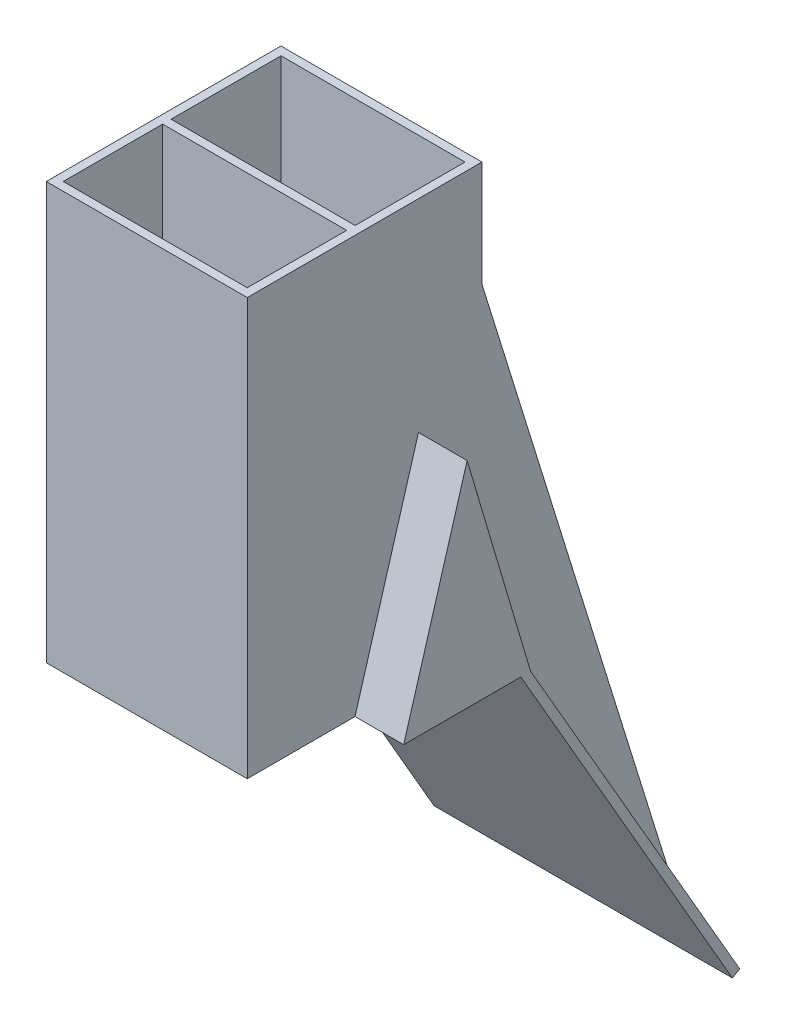
ISO-10303-21;
HEADER;
FILE_DESCRIPTION(('STEP AP214'),'2;1');
FILE_NAME('part.step','',(''),(''),'','','');
FILE_SCHEMA(('AUTOMOTIVE_DESIGN { 1 0 10303 214 1 1 1 1 }'));
ENDSEC;
DATA;
#1=APPLICATION_CONTEXT('core data for automotive mechanical design processes');
#2=APPLICATION_PROTOCOL_DEFINITION('international standard','automotive_design',2000,#1);
#3=PRODUCT_CONTEXT('',#1,'mechanical');
#4=PRODUCT('Part','Part','',(#3));
#5=PRODUCT_RELATED_PRODUCT_CATEGORY('part','',(#4));
#6=PRODUCT_DEFINITION_FORMATION('','',#4);
#7=PRODUCT_DEFINITION_CONTEXT('part definition',#1,'design');
#8=PRODUCT_DEFINITION('design','',#6,#7);
#9=PRODUCT_DEFINITION_SHAPE('','',#8);
#10=(LENGTH_UNIT() NAMED_UNIT(*) SI_UNIT(.MILLI.,.METRE.));
#11=(NAMED_UNIT(*) PLANE_ANGLE_UNIT() SI_UNIT($,.RADIAN.));
#12=(NAMED_UNIT(*) SI_UNIT($,.STERADIAN.) SOLID_ANGLE_UNIT());
#13=UNCERTAINTY_MEASURE_WITH_UNIT(LENGTH_MEASURE(1.E-05),#10,'distance_accuracy_value','');
#14=(GEOMETRIC_REPRESENTATION_CONTEXT(3) GLOBAL_UNCERTAINTY_ASSIGNED_CONTEXT((#13)) GLOBAL_UNIT_ASSIGNED_CONTEXT((#10,
#11,#12)) REPRESENTATION_CONTEXT('',''));
#15=CARTESIAN_POINT('',(0.,0.,0.));
#16=DIRECTION('',(0.,0.,1.));
#17=DIRECTION('',(1.,0.,0.));
#18=AXIS2_PLACEMENT_3D('',#15,#16,#17);
#19=CARTESIAN_POINT('',(11.8,-17.1205080756888,-20.9775299461621));
#20=DIRECTION('',(0.,0.5,-0.866025403784439));
#21=DIRECTION('',(0.,0.866025403784439,0.5));
#22=AXIS2_PLACEMENT_3D('',#19,#20,#21);
#23=PLANE('',#22);
#24=DIRECTION('',(1.,0.,0.));
#25=VECTOR('',#24,1.);
#26=CARTESIAN_POINT('',(-2.3,0.,-11.093));
#27=LINE('',#26,#25);
#28=CARTESIAN_POINT('',(-2.3,0.,-11.093));
#29=VERTEX_POINT('',#28);
#30=CARTESIAN_POINT('',(0.,0.,-11.093));
#31=VERTEX_POINT('',#30);
#32=EDGE_CURVE('E271',#29,#31,#27,.T.);
#33=ORIENTED_EDGE('',*,*,#32,.T.);
#34=DIRECTION('',(0.,0.866025403784438,0.5));
#35=VECTOR('',#34,1.);
#36=CARTESIAN_POINT('',(0.,-17.1205080756888,-20.9775299461621));
#37=LINE('',#36,#35);
#38=CARTESIAN_POINT('',(0.,-17.1205080756888,-20.9775299461621));
#39=VERTEX_POINT('',#38);
#40=EDGE_CURVE('E269',#39,#31,#37,.T.);
#41=ORIENTED_EDGE('',*,*,#40,.F.);
#42=DIRECTION('',(-1.,0.,0.));
#43=VECTOR('',#42,1.);
#44=CARTESIAN_POINT('',(11.8,-17.1205080756888,-20.9775299461621));
#45=LINE('',#44,#43);
#46=CARTESIAN_POINT('',(-2.3,-17.1205080756888,-20.9775299461621));
#47=VERTEX_POINT('',#46);
#48=EDGE_CURVE('E254',#39,#47,#45,.T.);
#49=ORIENTED_EDGE('',*,*,#48,.T.);
#50=DIRECTION('',(0.,-0.866025403784438,-0.5));
#51=VECTOR('',#50,1.);
#52=CARTESIAN_POINT('',(-2.3,-17.1205080756888,-20.9775299461621));
#53=LINE('',#52,#51);
#54=EDGE_CURVE('E295',#29,#47,#53,.T.);
#55=ORIENTED_EDGE('',*,*,#54,.F.);
#56=EDGE_LOOP('',(#33,#41,#49,#55));
#57=FACE_BOUND('',#56,.T.);
#58=ADVANCED_FACE('F39',(#57),#23,.T.);
#59=CARTESIAN_POINT('',(0.399999999999999,19.7,-5.5));
#60=DIRECTION('',(1.,0.,0.));
#61=DIRECTION('',(0.,0.,-1.));
#62=AXIS2_PLACEMENT_3D('',#59,#60,#61);
#63=PLANE('',#62);
#64=DIRECTION('',(0.,-0.958836299508465,0.283959417426001));
#65=VECTOR('',#64,1.);
#66=CARTESIAN_POINT('',(0.4,18.10876123634,-10.8730828919585));
#67=LINE('',#66,#65);
#68=CARTESIAN_POINT('',(0.399999999999999,8.7213480044935,-8.093));
#69=VERTEX_POINT('',#68);
#70=CARTESIAN_POINT('',(0.399999999999999,1.,-5.80632240735632));
#71=VERTEX_POINT('',#70);
#72=EDGE_CURVE('E429',#69,#71,#67,.T.);
#73=ORIENTED_EDGE('',*,*,#72,.F.);
#74=DIRECTION('',(0.,0.958836299508465,0.283959417426001));
#75=VECTOR('',#74,1.);
#76=CARTESIAN_POINT('',(0.399999999999999,19.5207565524615,-4.89475462547838));
#77=LINE('',#76,#75);
#78=CARTESIAN_POINT('',(0.4,0.999999999999997,-10.3796775926437));
#79=VERTEX_POINT('',#78);
#80=EDGE_CURVE('E415',#79,#69,#77,.T.);
#81=ORIENTED_EDGE('',*,*,#80,.F.);
#82=DIRECTION('',(0.,0.,-1.));
#83=VECTOR('',#82,1.);
#84=CARTESIAN_POINT('',(0.399999999999999,1.,-5.5));
#85=LINE('',#84,#83);
#86=EDGE_CURVE('E421',#71,#79,#85,.T.);
#87=ORIENTED_EDGE('',*,*,#86,.F.);
#88=EDGE_LOOP('',(#73,#81,#87));
#89=FACE_BOUND('',#88,.T.);
#90=DIRECTION('',(0.,-1.,0.));
#91=VECTOR('',#90,1.);
#92=CARTESIAN_POINT('',(0.399999999999999,19.7,-5.5));
#93=LINE('',#92,#91);
#94=CARTESIAN_POINT('',(0.399999999999999,19.7,-5.5));
#95=VERTEX_POINT('',#94);
#96=CARTESIAN_POINT('',(0.399999999999999,0.4,-5.5));
#97=VERTEX_POINT('',#96);
#98=EDGE_CURVE('E520',#95,#97,#93,.T.);
#99=ORIENTED_EDGE('',*,*,#98,.T.);
#100=DIRECTION('',(0.,0.,-1.));
#101=VECTOR('',#100,1.);
#102=CARTESIAN_POINT('',(0.399999999999999,0.400000000000001,-5.5));
#103=LINE('',#102,#101);
#104=CARTESIAN_POINT('',(0.4,0.400000000000001,-10.693));
#105=VERTEX_POINT('',#104);
#106=EDGE_CURVE('E371',#97,#105,#103,.T.);
#107=ORIENTED_EDGE('',*,*,#106,.T.);
#108=DIRECTION('',(0.,-1.,0.));
#109=VECTOR('',#108,1.);
#110=CARTESIAN_POINT('',(0.4,19.7,-10.693));
#111=LINE('',#110,#109);
#112=CARTESIAN_POINT('',(0.4,19.7,-10.693));
#113=VERTEX_POINT('',#112);
#114=EDGE_CURVE('E503',#113,#105,#111,.T.);
#115=ORIENTED_EDGE('',*,*,#114,.F.);
#116=DIRECTION('',(0.,0.,1.));
#117=VECTOR('',#116,1.);
#118=CARTESIAN_POINT('',(0.399999999999999,19.7,-5.5));
#119=LINE('',#118,#117);
#120=EDGE_CURVE('E489',#113,#95,#119,.T.);
#121=ORIENTED_EDGE('',*,*,#120,.T.);
#122=EDGE_LOOP('',(#99,#107,#115,#121));
#123=FACE_BOUND('',#122,.T.);
#124=ADVANCED_FACE('F660',(#89,#123),#63,.T.);
#125=CARTESIAN_POINT('',(9.1,19.7,-5.5));
#126=DIRECTION('',(-1.,0.,0.));
#127=DIRECTION('',(0.,0.,1.));
#128=AXIS2_PLACEMENT_3D('',#125,#126,#127);
#129=PLANE('',#128);
#130=DIRECTION('',(0.,0.958836299508465,-0.283959417426001));
#131=VECTOR('',#130,1.);
#132=CARTESIAN_POINT('',(9.1,18.10876123634,-10.8730828919585));
#133=LINE('',#132,#131);
#134=CARTESIAN_POINT('',(9.1,1.,-5.80632240735632));
#135=VERTEX_POINT('',#134);
#136=CARTESIAN_POINT('',(9.1,8.7213480044935,-8.093));
#137=VERTEX_POINT('',#136);
#138=EDGE_CURVE('E425',#135,#137,#133,.T.);
#139=ORIENTED_EDGE('',*,*,#138,.F.);
#140=DIRECTION('',(0.,0.,1.));
#141=VECTOR('',#140,1.);
#142=CARTESIAN_POINT('',(9.1,1.,-5.5));
#143=LINE('',#142,#141);
#144=CARTESIAN_POINT('',(9.1,1.,-10.3796775926437));
#145=VERTEX_POINT('',#144);
#146=EDGE_CURVE('E418',#145,#135,#143,.T.);
#147=ORIENTED_EDGE('',*,*,#146,.F.);
#148=DIRECTION('',(0.,-0.958836299508465,-0.283959417426001));
#149=VECTOR('',#148,1.);
#150=CARTESIAN_POINT('',(9.1,19.5207565524615,-4.89475462547838));
#151=LINE('',#150,#149);
#152=EDGE_CURVE('E403',#137,#145,#151,.T.);
#153=ORIENTED_EDGE('',*,*,#152,.F.);
#154=EDGE_LOOP('',(#139,#147,#153));
#155=FACE_BOUND('',#154,.T.);
#156=DIRECTION('',(0.,-1.,0.));
#157=VECTOR('',#156,1.);
#158=CARTESIAN_POINT('',(9.1,19.7,-10.693));
#159=LINE('',#158,#157);
#160=CARTESIAN_POINT('',(9.1,19.7,-10.693));
#161=VERTEX_POINT('',#160);
#162=CARTESIAN_POINT('',(9.1,0.4,-10.693));
#163=VERTEX_POINT('',#162);
#164=EDGE_CURVE('E512',#161,#163,#159,.T.);
#165=ORIENTED_EDGE('',*,*,#164,.T.);
#166=DIRECTION('',(0.,0.,1.));
#167=VECTOR('',#166,1.);
#168=CARTESIAN_POINT('',(9.1,0.400000000000001,-5.5));
#169=LINE('',#168,#167);
#170=CARTESIAN_POINT('',(9.1,0.400000000000001,-5.5));
#171=VERTEX_POINT('',#170);
#172=EDGE_CURVE('E356',#163,#171,#169,.T.);
#173=ORIENTED_EDGE('',*,*,#172,.T.);
#174=DIRECTION('',(0.,-1.,0.));
#175=VECTOR('',#174,1.);
#176=CARTESIAN_POINT('',(9.1,19.7,-5.5));
#177=LINE('',#176,#175);
#178=CARTESIAN_POINT('',(9.1,19.7,-5.5));
#179=VERTEX_POINT('',#178);
#180=EDGE_CURVE('E516',#179,#171,#177,.T.);
#181=ORIENTED_EDGE('',*,*,#180,.F.);
#182=DIRECTION('',(0.,0.,-1.));
#183=VECTOR('',#182,1.);
#184=CARTESIAN_POINT('',(9.1,19.7,-5.5));
#185=LINE('',#184,#183);
#186=EDGE_CURVE('E496',#179,#161,#185,.T.);
#187=ORIENTED_EDGE('',*,*,#186,.T.);
#188=EDGE_LOOP('',(#165,#173,#181,#187));
#189=FACE_BOUND('',#188,.T.);
#190=ADVANCED_FACE('F665',(#155,#189),#129,.T.);
#191=CARTESIAN_POINT('',(0.,19.7,0.));
#192=DIRECTION('',(1.,0.,0.));
#193=DIRECTION('',(0.,0.,-1.));
#194=AXIS2_PLACEMENT_3D('',#191,#192,#193);
#195=PLANE('',#194);
#196=DIRECTION('',(0.,-0.958836299508464,-0.283959417426001));
#197=VECTOR('',#196,1.);
#198=CARTESIAN_POINT('',(0.,0.,-11.093));
#199=LINE('',#198,#197);
#200=CARTESIAN_POINT('',(0.,10.13,-8.093));
#201=VERTEX_POINT('',#200);
#202=EDGE_CURVE('E466',#201,#31,#199,.T.);
#203=ORIENTED_EDGE('',*,*,#202,.F.);
#204=DIRECTION('',(0.,0.958836299508464,-0.283959417426001));
#205=VECTOR('',#204,1.);
#206=CARTESIAN_POINT('',(0.,10.13,-8.093));
#207=LINE('',#206,#205);
#208=CARTESIAN_POINT('',(0.,0.,-5.093));
#209=VERTEX_POINT('',#208);
#210=EDGE_CURVE('E461',#209,#201,#207,.T.);
#211=ORIENTED_EDGE('',*,*,#210,.F.);
#212=DIRECTION('',(0.,0.,1.));
#213=VECTOR('',#212,1.);
#214=CARTESIAN_POINT('',(0.,0.,0.));
#215=LINE('',#214,#213);
#216=CARTESIAN_POINT('',(0.,0.,0.));
#217=VERTEX_POINT('',#216);
#218=EDGE_CURVE('E567',#209,#217,#215,.T.);
#219=ORIENTED_EDGE('',*,*,#218,.T.);
#220=DIRECTION('',(0.,-1.,0.));
#221=VECTOR('',#220,1.);
#222=CARTESIAN_POINT('',(0.,19.7,0.));
#223=LINE('',#222,#221);
#224=CARTESIAN_POINT('',(0.,19.7,0.));
#225=VERTEX_POINT('',#224);
#226=EDGE_CURVE('E11',#225,#217,#223,.T.);
#227=ORIENTED_EDGE('',*,*,#226,.F.);
#228=DIRECTION('',(0.,0.,1.));
#229=VECTOR('',#228,1.);
#230=CARTESIAN_POINT('',(0.,19.7,0.));
#231=LINE('',#230,#229);
#232=CARTESIAN_POINT('',(0.,19.7,-11.093));
#233=VERTEX_POINT('',#232);
#234=EDGE_CURVE('E568',#233,#225,#231,.T.);
#235=ORIENTED_EDGE('',*,*,#234,.F.);
#236=DIRECTION('',(0.,-1.,0.));
#237=VECTOR('',#236,1.);
#238=CARTESIAN_POINT('',(0.,19.7,-11.093));
#239=LINE('',#238,#237);
#240=CARTESIAN_POINT('',(0.,14.7,-11.093));
#241=VERTEX_POINT('',#240);
#242=EDGE_CURVE('E288',#233,#241,#239,.T.);
#243=ORIENTED_EDGE('',*,*,#242,.T.);
#244=DIRECTION('',(0.,-0.954985944356835,-0.296651051036202));
#245=VECTOR('',#244,1.);
#246=CARTESIAN_POINT('',(0.,14.7,-11.093));
#247=LINE('',#246,#245);
#248=EDGE_CURVE('E277',#241,#39,#247,.T.);
#249=ORIENTED_EDGE('',*,*,#248,.T.);
#250=ORIENTED_EDGE('',*,*,#40,.T.);
#251=EDGE_LOOP('',(#203,#211,#219,#227,#235,#243,#249,#250));
#252=FACE_BOUND('',#251,.T.);
#253=ADVANCED_FACE('F41',(#252),#195,.F.);
#254=CARTESIAN_POINT('',(0.,19.7,0.));
#255=DIRECTION('',(0.,-1.,0.));
#256=DIRECTION('',(0.,0.,-1.));
#257=AXIS2_PLACEMENT_3D('',#254,#255,#256);
#258=PLANE('',#257);
#259=DIRECTION('',(1.,0.,0.));
#260=VECTOR('',#259,1.);
#261=CARTESIAN_POINT('',(0.4,19.7,-0.4));
#262=LINE('',#261,#260);
#263=CARTESIAN_POINT('',(0.4,19.7,-0.4));
#264=VERTEX_POINT('',#263);
#265=CARTESIAN_POINT('',(9.1,19.7,-0.4));
#266=VERTEX_POINT('',#265);
#267=EDGE_CURVE('E525',#264,#266,#262,.T.);
#268=ORIENTED_EDGE('',*,*,#267,.F.);
#269=DIRECTION('',(0.,0.,1.));
#270=VECTOR('',#269,1.);
#271=CARTESIAN_POINT('',(0.4,19.7,-0.4));
#272=LINE('',#271,#270);
#273=CARTESIAN_POINT('',(0.4,19.7,-5.1));
#274=VERTEX_POINT('',#273);
#275=EDGE_CURVE('E536',#274,#264,#272,.T.);
#276=ORIENTED_EDGE('',*,*,#275,.F.);
#277=DIRECTION('',(-1.,0.,0.));
#278=VECTOR('',#277,1.);
#279=CARTESIAN_POINT('',(0.4,19.7,-5.1));
#280=LINE('',#279,#278);
#281=CARTESIAN_POINT('',(9.1,19.7,-5.1));
#282=VERTEX_POINT('',#281);
#283=EDGE_CURVE('E532',#282,#274,#280,.T.);
#284=ORIENTED_EDGE('',*,*,#283,.F.);
#285=DIRECTION('',(0.,0.,-1.));
#286=VECTOR('',#285,1.);
#287=CARTESIAN_POINT('',(9.1,19.7,-0.4));
#288=LINE('',#287,#286);
#289=EDGE_CURVE('E528',#266,#282,#288,.T.);
#290=ORIENTED_EDGE('',*,*,#289,.F.);
#291=EDGE_LOOP('',(#268,#276,#284,#290));
#292=FACE_BOUND('',#291,.T.);
#293=ORIENTED_EDGE('',*,*,#234,.T.);
#294=DIRECTION('',(1.,0.,0.));
#295=VECTOR('',#294,1.);
#296=CARTESIAN_POINT('',(0.,19.7,0.));
#297=LINE('',#296,#295);
#298=CARTESIAN_POINT('',(9.5,19.7,0.));
#299=VERTEX_POINT('',#298);
#300=EDGE_CURVE('E572',#225,#299,#297,.T.);
#301=ORIENTED_EDGE('',*,*,#300,.T.);
#302=DIRECTION('',(0.,0.,-1.));
#303=VECTOR('',#302,1.);
#304=CARTESIAN_POINT('',(9.5,19.7,0.));
#305=LINE('',#304,#303);
#306=CARTESIAN_POINT('',(9.5,19.7,-11.093));
#307=VERTEX_POINT('',#306);
#308=EDGE_CURVE('E576',#299,#307,#305,.T.);
#309=ORIENTED_EDGE('',*,*,#308,.T.);
#310=DIRECTION('',(-1.,0.,0.));
#311=VECTOR('',#310,1.);
#312=CARTESIAN_POINT('',(0.,19.7,-11.093));
#313=LINE('',#312,#311);
#314=EDGE_CURVE('E579',#307,#233,#313,.T.);
#315=ORIENTED_EDGE('',*,*,#314,.T.);
#316=EDGE_LOOP('',(#293,#301,#309,#315));
#317=FACE_BOUND('',#316,.T.);
#318=ORIENTED_EDGE('',*,*,#120,.F.);
#319=DIRECTION('',(-1.,0.,0.));
#320=VECTOR('',#319,1.);
#321=CARTESIAN_POINT('',(0.4,19.7,-10.693));
#322=LINE('',#321,#320);
#323=EDGE_CURVE('E500',#161,#113,#322,.T.);
#324=ORIENTED_EDGE('',*,*,#323,.F.);
#325=ORIENTED_EDGE('',*,*,#186,.F.);
#326=DIRECTION('',(1.,0.,0.));
#327=VECTOR('',#326,1.);
#328=CARTESIAN_POINT('',(9.1,19.7,-5.5));
#329=LINE('',#328,#327);
#330=EDGE_CURVE('E492',#95,#179,#329,.T.);
#331=ORIENTED_EDGE('',*,*,#330,.F.);
#332=EDGE_LOOP('',(#318,#324,#325,#331));
#333=FACE_BOUND('',#332,.T.);
#334=ADVANCED_FACE('F644',(#292,#317,#333),#258,.F.);
#335=CARTESIAN_POINT('',(0.,0.,0.));
#336=DIRECTION('',(0.,-1.,0.));
#337=DIRECTION('',(0.,0.,-1.));
#338=AXIS2_PLACEMENT_3D('',#335,#336,#337);
#339=PLANE('',#338);
#340=DIRECTION('',(-1.,0.,0.));
#341=VECTOR('',#340,1.);
#342=CARTESIAN_POINT('',(11.8,0.,-10.6311197846483));
#343=LINE('',#342,#341);
#344=CARTESIAN_POINT('',(11.8,0.,-10.6311197846483));
#345=VERTEX_POINT('',#344);
#346=CARTESIAN_POINT('',(11.4,0.,-10.6311197846483));
#347=VERTEX_POINT('',#346);
#348=EDGE_CURVE('E315',#345,#347,#343,.T.);
#349=ORIENTED_EDGE('',*,*,#348,.F.);
#350=DIRECTION('',(0.,0.,1.));
#351=VECTOR('',#350,1.);
#352=CARTESIAN_POINT('',(11.8,0.,-5.093));
#353=LINE('',#352,#351);
#354=CARTESIAN_POINT('',(11.8,0.,-5.093));
#355=VERTEX_POINT('',#354);
#356=EDGE_CURVE('E433',#345,#355,#353,.T.);
#357=ORIENTED_EDGE('',*,*,#356,.T.);
#358=DIRECTION('',(-1.,0.,0.));
#359=VECTOR('',#358,1.);
#360=CARTESIAN_POINT('',(11.8,0.,-5.093));
#361=LINE('',#360,#359);
#362=CARTESIAN_POINT('',(9.5,0.,-5.093));
#363=VERTEX_POINT('',#362);
#364=EDGE_CURVE('E445',#355,#363,#361,.T.);
#365=ORIENTED_EDGE('',*,*,#364,.T.);
#366=DIRECTION('',(0.,0.,-1.));
#367=VECTOR('',#366,1.);
#368=CARTESIAN_POINT('',(9.5,0.,0.));
#369=LINE('',#368,#367);
#370=CARTESIAN_POINT('',(9.5,0.,0.));
#371=VERTEX_POINT('',#370);
#372=EDGE_CURVE('E573',#371,#363,#369,.T.);
#373=ORIENTED_EDGE('',*,*,#372,.F.);
#374=DIRECTION('',(1.,0.,0.));
#375=VECTOR('',#374,1.);
#376=CARTESIAN_POINT('',(0.,0.,0.));
#377=LINE('',#376,#375);
#378=EDGE_CURVE('E584',#217,#371,#377,.T.);
#379=ORIENTED_EDGE('',*,*,#378,.F.);
#380=ORIENTED_EDGE('',*,*,#218,.F.);
#381=DIRECTION('',(1.,0.,0.));
#382=VECTOR('',#381,1.);
#383=CARTESIAN_POINT('',(-2.3,0.,-5.093));
#384=LINE('',#383,#382);
#385=CARTESIAN_POINT('',(-2.3,0.,-5.093));
#386=VERTEX_POINT('',#385);
#387=EDGE_CURVE('E484',#386,#209,#384,.T.);
#388=ORIENTED_EDGE('',*,*,#387,.F.);
#389=DIRECTION('',(0.,0.,1.));
#390=VECTOR('',#389,1.);
#391=CARTESIAN_POINT('',(-2.3,0.,-5.093));
#392=LINE('',#391,#390);
#393=CARTESIAN_POINT('',(-2.3,0.,-10.6311197846483));
#394=VERTEX_POINT('',#393);
#395=EDGE_CURVE('E462',#394,#386,#392,.T.);
#396=ORIENTED_EDGE('',*,*,#395,.F.);
#397=CARTESIAN_POINT('',(-1.9,0.,-10.6311197846483));
#398=VERTEX_POINT('',#397);
#399=EDGE_CURVE('E321',#398,#394,#343,.T.);
#400=ORIENTED_EDGE('',*,*,#399,.F.);
#401=DIRECTION('',(0.,0.,-1.));
#402=VECTOR('',#401,1.);
#403=CARTESIAN_POINT('',(-1.9,0.,-5.5));
#404=LINE('',#403,#402);
#405=CARTESIAN_POINT('',(-1.9,0.,-5.5));
#406=VERTEX_POINT('',#405);
#407=EDGE_CURVE('E344',#406,#398,#404,.T.);
#408=ORIENTED_EDGE('',*,*,#407,.F.);
#409=DIRECTION('',(1.,0.,0.));
#410=VECTOR('',#409,1.);
#411=CARTESIAN_POINT('',(9.1,0.,-5.5));
#412=LINE('',#411,#410);
#413=CARTESIAN_POINT('',(11.4,0.,-5.5));
#414=VERTEX_POINT('',#413);
#415=EDGE_CURVE('E488',#406,#414,#412,.T.);
#416=ORIENTED_EDGE('',*,*,#415,.T.);
#417=DIRECTION('',(0.,0.,1.));
#418=VECTOR('',#417,1.);
#419=CARTESIAN_POINT('',(11.4,0.,-5.5));
#420=LINE('',#419,#418);
#421=EDGE_CURVE('E348',#347,#414,#420,.T.);
#422=ORIENTED_EDGE('',*,*,#421,.F.);
#423=EDGE_LOOP('',(#349,#357,#365,#373,#379,#380,#388,#396,#400,#408,#416,#422));
#424=FACE_BOUND('',#423,.T.);
#425=DIRECTION('',(0.,0.,1.));
#426=VECTOR('',#425,1.);
#427=CARTESIAN_POINT('',(0.4,0.,-0.4));
#428=LINE('',#427,#426);
#429=CARTESIAN_POINT('',(0.4,0.,-5.1));
#430=VERTEX_POINT('',#429);
#431=CARTESIAN_POINT('',(0.4,0.,-0.4));
#432=VERTEX_POINT('',#431);
#433=EDGE_CURVE('E529',#430,#432,#428,.T.);
#434=ORIENTED_EDGE('',*,*,#433,.T.);
#435=DIRECTION('',(1.,0.,0.));
#436=VECTOR('',#435,1.);
#437=CARTESIAN_POINT('',(0.4,0.,-0.4));
#438=LINE('',#437,#436);
#439=CARTESIAN_POINT('',(9.1,0.,-0.4));
#440=VERTEX_POINT('',#439);
#441=EDGE_CURVE('E524',#432,#440,#438,.T.);
#442=ORIENTED_EDGE('',*,*,#441,.T.);
#443=DIRECTION('',(0.,0.,-1.));
#444=VECTOR('',#443,1.);
#445=CARTESIAN_POINT('',(9.1,0.,-0.4));
#446=LINE('',#445,#444);
#447=CARTESIAN_POINT('',(9.1,0.,-5.1));
#448=VERTEX_POINT('',#447);
#449=EDGE_CURVE('E543',#440,#448,#446,.T.);
#450=ORIENTED_EDGE('',*,*,#449,.T.);
#451=DIRECTION('',(-1.,0.,0.));
#452=VECTOR('',#451,1.);
#453=CARTESIAN_POINT('',(0.4,0.,-5.1));
#454=LINE('',#453,#452);
#455=EDGE_CURVE('E547',#448,#430,#454,.T.);
#456=ORIENTED_EDGE('',*,*,#455,.T.);
#457=EDGE_LOOP('',(#434,#442,#450,#456));
#458=FACE_BOUND('',#457,.T.);
#459=ADVANCED_FACE('F604',(#424,#458),#339,.T.);
#460=CARTESIAN_POINT('',(0.,19.7,0.));
#461=DIRECTION('',(0.,0.,-1.));
#462=DIRECTION('',(-1.,0.,0.));
#463=AXIS2_PLACEMENT_3D('',#460,#461,#462);
#464=PLANE('',#463);
#465=ORIENTED_EDGE('',*,*,#378,.T.);
#466=DIRECTION('',(0.,-1.,0.));
#467=VECTOR('',#466,1.);
#468=CARTESIAN_POINT('',(9.5,19.7,0.));
#469=LINE('',#468,#467);
#470=EDGE_CURVE('E48',#299,#371,#469,.T.);
#471=ORIENTED_EDGE('',*,*,#470,.F.);
#472=ORIENTED_EDGE('',*,*,#300,.F.);
#473=ORIENTED_EDGE('',*,*,#226,.T.);
#474=EDGE_LOOP('',(#465,#471,#472,#473));
#475=FACE_BOUND('',#474,.T.);
#476=ADVANCED_FACE('F642',(#475),#464,.F.);
#477=CARTESIAN_POINT('',(9.5,19.7,0.));
#478=DIRECTION('',(-1.,0.,0.));
#479=DIRECTION('',(0.,0.,1.));
#480=AXIS2_PLACEMENT_3D('',#477,#478,#479);
#481=PLANE('',#480);
#482=ORIENTED_EDGE('',*,*,#372,.T.);
#483=DIRECTION('',(0.,0.958836299508464,-0.283959417426001));
#484=VECTOR('',#483,1.);
#485=CARTESIAN_POINT('',(9.5,10.13,-8.093));
#486=LINE('',#485,#484);
#487=CARTESIAN_POINT('',(9.5,10.13,-8.093));
#488=VERTEX_POINT('',#487);
#489=EDGE_CURVE('E437',#363,#488,#486,.T.);
#490=ORIENTED_EDGE('',*,*,#489,.T.);
#491=DIRECTION('',(0.,-0.958836299508464,-0.283959417426001));
#492=VECTOR('',#491,1.);
#493=CARTESIAN_POINT('',(9.5,0.,-11.093));
#494=LINE('',#493,#492);
#495=CARTESIAN_POINT('',(9.5,0.,-11.093));
#496=VERTEX_POINT('',#495);
#497=EDGE_CURVE('E432',#488,#496,#494,.T.);
#498=ORIENTED_EDGE('',*,*,#497,.T.);
#499=DIRECTION('',(0.,0.866025403784438,0.5));
#500=VECTOR('',#499,1.);
#501=CARTESIAN_POINT('',(9.5,-17.1205080756888,-20.9775299461621));
#502=LINE('',#501,#500);
#503=CARTESIAN_POINT('',(9.5,-17.1205080756888,-20.9775299461621));
#504=VERTEX_POINT('',#503);
#505=EDGE_CURVE('E285',#504,#496,#502,.T.);
#506=ORIENTED_EDGE('',*,*,#505,.F.);
#507=DIRECTION('',(0.,-0.954985944356835,-0.296651051036202));
#508=VECTOR('',#507,1.);
#509=CARTESIAN_POINT('',(9.5,14.7,-11.093));
#510=LINE('',#509,#508);
#511=CARTESIAN_POINT('',(9.5,14.7,-11.093));
#512=VERTEX_POINT('',#511);
#513=EDGE_CURVE('E276',#512,#504,#510,.T.);
#514=ORIENTED_EDGE('',*,*,#513,.F.);
#515=DIRECTION('',(0.,-1.,0.));
#516=VECTOR('',#515,1.);
#517=CARTESIAN_POINT('',(9.5,19.7,-11.093));
#518=LINE('',#517,#516);
#519=EDGE_CURVE('E55',#307,#512,#518,.T.);
#520=ORIENTED_EDGE('',*,*,#519,.F.);
#521=ORIENTED_EDGE('',*,*,#308,.F.);
#522=ORIENTED_EDGE('',*,*,#470,.T.);
#523=EDGE_LOOP('',(#482,#490,#498,#506,#514,#520,#521,#522));
#524=FACE_BOUND('',#523,.T.);
#525=ADVANCED_FACE('F599',(#524),#481,.F.);
#526=CARTESIAN_POINT('',(0.,19.7,-11.093));
#527=DIRECTION('',(0.,0.,1.));
#528=DIRECTION('',(1.,0.,0.));
#529=AXIS2_PLACEMENT_3D('',#526,#527,#528);
#530=PLANE('',#529);
#531=ORIENTED_EDGE('',*,*,#519,.T.);
#532=DIRECTION('',(-1.,0.,0.));
#533=VECTOR('',#532,1.);
#534=CARTESIAN_POINT('',(9.5,14.7,-11.093));
#535=LINE('',#534,#533);
#536=EDGE_CURVE('E59',#512,#241,#535,.T.);
#537=ORIENTED_EDGE('',*,*,#536,.T.);
#538=ORIENTED_EDGE('',*,*,#242,.F.);
#539=ORIENTED_EDGE('',*,*,#314,.F.);
#540=EDGE_LOOP('',(#531,#537,#538,#539));
#541=FACE_BOUND('',#540,.T.);
#542=ADVANCED_FACE('F646',(#541),#530,.F.);
#543=CARTESIAN_POINT('',(0.4,19.7,-0.4));
#544=DIRECTION('',(0.,0.,-1.));
#545=DIRECTION('',(-1.,0.,0.));
#546=AXIS2_PLACEMENT_3D('',#543,#544,#545);
#547=PLANE('',#546);
#548=ORIENTED_EDGE('',*,*,#441,.F.);
#549=DIRECTION('',(0.,-1.,0.));
#550=VECTOR('',#549,1.);
#551=CARTESIAN_POINT('',(0.4,19.7,-0.4));
#552=LINE('',#551,#550);
#553=EDGE_CURVE('E539',#264,#432,#552,.T.);
#554=ORIENTED_EDGE('',*,*,#553,.F.);
#555=ORIENTED_EDGE('',*,*,#267,.T.);
#556=DIRECTION('',(0.,-1.,0.));
#557=VECTOR('',#556,1.);
#558=CARTESIAN_POINT('',(9.1,19.7,-0.4));
#559=LINE('',#558,#557);
#560=EDGE_CURVE('E563',#266,#440,#559,.T.);
#561=ORIENTED_EDGE('',*,*,#560,.T.);
#562=EDGE_LOOP('',(#548,#554,#555,#561));
#563=FACE_BOUND('',#562,.T.);
#564=ADVANCED_FACE('F648',(#563),#547,.T.);
#565=CARTESIAN_POINT('',(9.1,19.7,-0.4));
#566=DIRECTION('',(-1.,0.,0.));
#567=DIRECTION('',(0.,0.,1.));
#568=AXIS2_PLACEMENT_3D('',#565,#566,#567);
#569=PLANE('',#568);
#570=ORIENTED_EDGE('',*,*,#449,.F.);
#571=ORIENTED_EDGE('',*,*,#560,.F.);
#572=ORIENTED_EDGE('',*,*,#289,.T.);
#573=DIRECTION('',(0.,-1.,0.));
#574=VECTOR('',#573,1.);
#575=CARTESIAN_POINT('',(9.1,19.7,-5.1));
#576=LINE('',#575,#574);
#577=EDGE_CURVE('E560',#282,#448,#576,.T.);
#578=ORIENTED_EDGE('',*,*,#577,.T.);
#579=EDGE_LOOP('',(#570,#571,#572,#578));
#580=FACE_BOUND('',#579,.T.);
#581=ADVANCED_FACE('F654',(#580),#569,.T.);
#582=CARTESIAN_POINT('',(0.4,19.7,-5.1));
#583=DIRECTION('',(0.,0.,1.));
#584=DIRECTION('',(1.,0.,0.));
#585=AXIS2_PLACEMENT_3D('',#582,#583,#584);
#586=PLANE('',#585);
#587=ORIENTED_EDGE('',*,*,#455,.F.);
#588=ORIENTED_EDGE('',*,*,#577,.F.);
#589=ORIENTED_EDGE('',*,*,#283,.T.);
#590=DIRECTION('',(0.,-1.,0.));
#591=VECTOR('',#590,1.);
#592=CARTESIAN_POINT('',(0.4,19.7,-5.1));
#593=LINE('',#592,#591);
#594=EDGE_CURVE('E557',#274,#430,#593,.T.);
#595=ORIENTED_EDGE('',*,*,#594,.T.);
#596=EDGE_LOOP('',(#587,#588,#589,#595));
#597=FACE_BOUND('',#596,.T.);
#598=ADVANCED_FACE('F943',(#597),#586,.T.);
#599=CARTESIAN_POINT('',(0.4,19.7,-0.4));
#600=DIRECTION('',(1.,0.,0.));
#601=DIRECTION('',(0.,0.,-1.));
#602=AXIS2_PLACEMENT_3D('',#599,#600,#601);
#603=PLANE('',#602);
#604=ORIENTED_EDGE('',*,*,#433,.F.);
#605=ORIENTED_EDGE('',*,*,#594,.F.);
#606=ORIENTED_EDGE('',*,*,#275,.T.);
#607=ORIENTED_EDGE('',*,*,#553,.T.);
#608=EDGE_LOOP('',(#604,#605,#606,#607));
#609=FACE_BOUND('',#608,.T.);
#610=ADVANCED_FACE('F843',(#609),#603,.T.);
#611=CARTESIAN_POINT('',(9.1,19.7,-5.5));
#612=DIRECTION('',(0.,0.,-1.));
#613=DIRECTION('',(-1.,0.,0.));
#614=AXIS2_PLACEMENT_3D('',#611,#612,#613);
#615=PLANE('',#614);
#616=ORIENTED_EDGE('',*,*,#415,.F.);
#617=DIRECTION('',(0.,-1.,0.));
#618=VECTOR('',#617,1.);
#619=CARTESIAN_POINT('',(-1.9,0.4,-5.5));
#620=LINE('',#619,#618);
#621=CARTESIAN_POINT('',(-1.9,0.4,-5.5));
#622=VERTEX_POINT('',#621);
#623=EDGE_CURVE('E352',#622,#406,#620,.T.);
#624=ORIENTED_EDGE('',*,*,#623,.F.);
#625=DIRECTION('',(-1.,0.,0.));
#626=VECTOR('',#625,1.);
#627=CARTESIAN_POINT('',(-1.9,0.4,-5.5));
#628=LINE('',#627,#626);
#629=EDGE_CURVE('E339',#97,#622,#628,.T.);
#630=ORIENTED_EDGE('',*,*,#629,.F.);
#631=ORIENTED_EDGE('',*,*,#98,.F.);
#632=ORIENTED_EDGE('',*,*,#330,.T.);
#633=ORIENTED_EDGE('',*,*,#180,.T.);
#634=CARTESIAN_POINT('',(11.4,0.4,-5.5));
#635=VERTEX_POINT('',#634);
#636=EDGE_CURVE('E340',#635,#171,#628,.T.);
#637=ORIENTED_EDGE('',*,*,#636,.F.);
#638=DIRECTION('',(0.,-1.,0.));
#639=VECTOR('',#638,1.);
#640=CARTESIAN_POINT('',(11.4,0.4,-5.5));
#641=LINE('',#640,#639);
#642=EDGE_CURVE('E357',#635,#414,#641,.T.);
#643=ORIENTED_EDGE('',*,*,#642,.T.);
#644=EDGE_LOOP('',(#616,#624,#630,#631,#632,#633,#637,#643));
#645=FACE_BOUND('',#644,.T.);
#646=ADVANCED_FACE('F811',(#645),#615,.T.);
#647=CARTESIAN_POINT('',(0.4,19.7,-10.693));
#648=DIRECTION('',(0.,0.,1.));
#649=DIRECTION('',(1.,0.,0.));
#650=AXIS2_PLACEMENT_3D('',#647,#648,#649);
#651=PLANE('',#650);
#652=DIRECTION('',(-1.,0.,0.));
#653=VECTOR('',#652,1.);
#654=CARTESIAN_POINT('',(0.4,0.,-10.693));
#655=LINE('',#654,#653);
#656=CARTESIAN_POINT('',(11.4,0.,-10.693));
#657=VERTEX_POINT('',#656);
#658=CARTESIAN_POINT('',(-1.9,0.,-10.693));
#659=VERTEX_POINT('',#658);
#660=EDGE_CURVE('E493',#657,#659,#655,.T.);
#661=ORIENTED_EDGE('',*,*,#660,.F.);
#662=DIRECTION('',(0.,-1.,0.));
#663=VECTOR('',#662,1.);
#664=CARTESIAN_POINT('',(11.4,0.4,-10.693));
#665=LINE('',#664,#663);
#666=CARTESIAN_POINT('',(11.4,0.4,-10.693));
#667=VERTEX_POINT('',#666);
#668=EDGE_CURVE('E361',#667,#657,#665,.T.);
#669=ORIENTED_EDGE('',*,*,#668,.F.);
#670=DIRECTION('',(1.,0.,0.));
#671=VECTOR('',#670,1.);
#672=CARTESIAN_POINT('',(-1.9,0.4,-10.693));
#673=LINE('',#672,#671);
#674=EDGE_CURVE('E330',#163,#667,#673,.T.);
#675=ORIENTED_EDGE('',*,*,#674,.F.);
#676=ORIENTED_EDGE('',*,*,#164,.F.);
#677=ORIENTED_EDGE('',*,*,#323,.T.);
#678=ORIENTED_EDGE('',*,*,#114,.T.);
#679=CARTESIAN_POINT('',(-1.9,0.4,-10.693));
#680=VERTEX_POINT('',#679);
#681=EDGE_CURVE('E332',#680,#105,#673,.T.);
#682=ORIENTED_EDGE('',*,*,#681,.F.);
#683=DIRECTION('',(0.,-1.,0.));
#684=VECTOR('',#683,1.);
#685=CARTESIAN_POINT('',(-1.9,0.4,-10.693));
#686=LINE('',#685,#684);
#687=EDGE_CURVE('E343',#680,#659,#686,.T.);
#688=ORIENTED_EDGE('',*,*,#687,.T.);
#689=EDGE_LOOP('',(#661,#669,#675,#676,#677,#678,#682,#688));
#690=FACE_BOUND('',#689,.T.);
#691=ADVANCED_FACE('F806',(#690),#651,.T.);
#692=CARTESIAN_POINT('',(-2.3,10.13,-8.093));
#693=DIRECTION('',(0.,-0.283959417426001,-0.958836299508465));
#694=DIRECTION('',(0.,0.958836299508465,-0.283959417426001));
#695=AXIS2_PLACEMENT_3D('',#692,#693,#694);
#696=PLANE('',#695);
#697=ORIENTED_EDGE('',*,*,#210,.T.);
#698=DIRECTION('',(1.,0.,0.));
#699=VECTOR('',#698,1.);
#700=CARTESIAN_POINT('',(-2.3,10.13,-8.093));
#701=LINE('',#700,#699);
#702=CARTESIAN_POINT('',(-2.3,10.13,-8.093));
#703=VERTEX_POINT('',#702);
#704=EDGE_CURVE('E480',#703,#201,#701,.T.);
#705=ORIENTED_EDGE('',*,*,#704,.F.);
#706=DIRECTION('',(0.,0.958836299508464,-0.283959417426001));
#707=VECTOR('',#706,1.);
#708=CARTESIAN_POINT('',(-2.3,10.13,-8.093));
#709=LINE('',#708,#707);
#710=EDGE_CURVE('E465',#386,#703,#709,.T.);
#711=ORIENTED_EDGE('',*,*,#710,.F.);
#712=ORIENTED_EDGE('',*,*,#387,.T.);
#713=EDGE_LOOP('',(#697,#705,#711,#712));
#714=FACE_BOUND('',#713,.T.);
#715=ADVANCED_FACE('F639',(#714),#696,.F.);
#716=CARTESIAN_POINT('',(-2.3,0.,-11.093));
#717=DIRECTION('',(0.,-0.283959417426001,0.958836299508465));
#718=DIRECTION('',(0.,-0.958836299508465,-0.283959417426001));
#719=AXIS2_PLACEMENT_3D('',#716,#717,#718);
#720=PLANE('',#719);
#721=ORIENTED_EDGE('',*,*,#202,.T.);
#722=ORIENTED_EDGE('',*,*,#32,.F.);
#723=DIRECTION('',(0.,-0.958836299508464,-0.283959417426001));
#724=VECTOR('',#723,1.);
#725=CARTESIAN_POINT('',(-2.3,0.,-11.093));
#726=LINE('',#725,#724);
#727=EDGE_CURVE('E469',#703,#29,#726,.T.);
#728=ORIENTED_EDGE('',*,*,#727,.F.);
#729=ORIENTED_EDGE('',*,*,#704,.T.);
#730=EDGE_LOOP('',(#721,#722,#728,#729));
#731=FACE_BOUND('',#730,.T.);
#732=ADVANCED_FACE('F637',(#731),#720,.F.);
#733=CARTESIAN_POINT('',(-2.3,0.,0.));
#734=DIRECTION('',(1.,0.,0.));
#735=DIRECTION('',(0.,0.,-1.));
#736=AXIS2_PLACEMENT_3D('',#733,#734,#735);
#737=PLANE('',#736);
#738=DIRECTION('',(0.,-0.958836299508465,-0.283959417426001));
#739=VECTOR('',#738,1.);
#740=CARTESIAN_POINT('',(-2.3,8.7213480044935,-8.093));
#741=LINE('',#740,#739);
#742=CARTESIAN_POINT('',(-2.3,8.7213480044935,-8.093));
#743=VERTEX_POINT('',#742);
#744=CARTESIAN_POINT('',(-2.3,1.,-10.3796775926437));
#745=VERTEX_POINT('',#744);
#746=EDGE_CURVE('E392',#743,#745,#741,.T.);
#747=ORIENTED_EDGE('',*,*,#746,.F.);
#748=DIRECTION('',(0.,0.958836299508465,-0.283959417426001));
#749=VECTOR('',#748,1.);
#750=CARTESIAN_POINT('',(-2.3,1.,-5.80632240735632));
#751=LINE('',#750,#749);
#752=CARTESIAN_POINT('',(-2.3,1.,-5.80632240735632));
#753=VERTEX_POINT('',#752);
#754=EDGE_CURVE('E375',#753,#743,#751,.T.);
#755=ORIENTED_EDGE('',*,*,#754,.F.);
#756=DIRECTION('',(0.,0.,1.));
#757=VECTOR('',#756,1.);
#758=CARTESIAN_POINT('',(-2.3,1.,-10.3796775926437));
#759=LINE('',#758,#757);
#760=EDGE_CURVE('E381',#745,#753,#759,.T.);
#761=ORIENTED_EDGE('',*,*,#760,.F.);
#762=EDGE_LOOP('',(#747,#755,#761));
#763=FACE_BOUND('',#762,.T.);
#764=ORIENTED_EDGE('',*,*,#727,.T.);
#765=ORIENTED_EDGE('',*,*,#54,.T.);
#766=DIRECTION('',(0.,-0.49999999999999,0.866025403784444));
#767=VECTOR('',#766,1.);
#768=CARTESIAN_POINT('',(-2.3,-17.1205080756888,-20.9775299461621));
#769=LINE('',#768,#767);
#770=CARTESIAN_POINT('',(-2.3,-17.3205080756888,-20.6311197846483));
#771=VERTEX_POINT('',#770);
#772=EDGE_CURVE('E261',#47,#771,#769,.T.);
#773=ORIENTED_EDGE('',*,*,#772,.T.);
#774=DIRECTION('',(0.,0.866025403784439,0.5));
#775=VECTOR('',#774,1.);
#776=CARTESIAN_POINT('',(-2.3,-17.3205080756888,-20.6311197846483));
#777=LINE('',#776,#775);
#778=EDGE_CURVE('E302',#771,#394,#777,.T.);
#779=ORIENTED_EDGE('',*,*,#778,.T.);
#780=ORIENTED_EDGE('',*,*,#395,.T.);
#781=ORIENTED_EDGE('',*,*,#710,.T.);
#782=EDGE_LOOP('',(#764,#765,#773,#779,#780,#781));
#783=FACE_BOUND('',#782,.T.);
#784=ADVANCED_FACE('F632',(#763,#783),#737,.F.);
#785=CARTESIAN_POINT('',(11.8,0.,-11.093));
#786=DIRECTION('',(0.,0.283959417426001,-0.958836299508465));
#787=DIRECTION('',(0.,0.958836299508465,0.283959417426001));
#788=AXIS2_PLACEMENT_3D('',#785,#786,#787);
#789=PLANE('',#788);
#790=ORIENTED_EDGE('',*,*,#497,.F.);
#791=DIRECTION('',(-1.,0.,0.));
#792=VECTOR('',#791,1.);
#793=CARTESIAN_POINT('',(11.8,10.13,-8.093));
#794=LINE('',#793,#792);
#795=CARTESIAN_POINT('',(11.8,10.13,-8.093));
#796=VERTEX_POINT('',#795);
#797=EDGE_CURVE('E454',#796,#488,#794,.T.);
#798=ORIENTED_EDGE('',*,*,#797,.F.);
#799=DIRECTION('',(0.,-0.958836299508464,-0.283959417426001));
#800=VECTOR('',#799,1.);
#801=CARTESIAN_POINT('',(11.8,0.,-11.093));
#802=LINE('',#801,#800);
#803=CARTESIAN_POINT('',(11.8,0.,-11.093));
#804=VERTEX_POINT('',#803);
#805=EDGE_CURVE('E436',#796,#804,#802,.T.);
#806=ORIENTED_EDGE('',*,*,#805,.T.);
#807=DIRECTION('',(-1.,0.,0.));
#808=VECTOR('',#807,1.);
#809=CARTESIAN_POINT('',(11.8,0.,-11.093));
#810=LINE('',#809,#808);
#811=EDGE_CURVE('E457',#804,#496,#810,.T.);
#812=ORIENTED_EDGE('',*,*,#811,.T.);
#813=EDGE_LOOP('',(#790,#798,#806,#812));
#814=FACE_BOUND('',#813,.T.);
#815=ADVANCED_FACE('F616',(#814),#789,.T.);
#816=CARTESIAN_POINT('',(11.8,10.13,-8.093));
#817=DIRECTION('',(0.,0.283959417426001,0.958836299508465));
#818=DIRECTION('',(0.,-0.958836299508465,0.283959417426001));
#819=AXIS2_PLACEMENT_3D('',#816,#817,#818);
#820=PLANE('',#819);
#821=ORIENTED_EDGE('',*,*,#489,.F.);
#822=ORIENTED_EDGE('',*,*,#364,.F.);
#823=DIRECTION('',(0.,0.958836299508464,-0.283959417426001));
#824=VECTOR('',#823,1.);
#825=CARTESIAN_POINT('',(11.8,10.13,-8.093));
#826=LINE('',#825,#824);
#827=EDGE_CURVE('E441',#355,#796,#826,.T.);
#828=ORIENTED_EDGE('',*,*,#827,.T.);
#829=ORIENTED_EDGE('',*,*,#797,.T.);
#830=EDGE_LOOP('',(#821,#822,#828,#829));
#831=FACE_BOUND('',#830,.T.);
#832=ADVANCED_FACE('F612',(#831),#820,.T.);
#833=CARTESIAN_POINT('',(11.8,0.,0.));
#834=DIRECTION('',(-1.,0.,0.));
#835=DIRECTION('',(0.,0.,-1.));
#836=AXIS2_PLACEMENT_3D('',#833,#834,#835);
#837=PLANE('',#836);
#838=ORIENTED_EDGE('',*,*,#356,.F.);
#839=DIRECTION('',(0.,0.866025403784439,0.5));
#840=VECTOR('',#839,1.);
#841=CARTESIAN_POINT('',(11.8,-17.3205080756888,-20.6311197846483));
#842=LINE('',#841,#840);
#843=CARTESIAN_POINT('',(11.8,-17.3205080756888,-20.6311197846483));
#844=VERTEX_POINT('',#843);
#845=EDGE_CURVE('E266',#844,#345,#842,.T.);
#846=ORIENTED_EDGE('',*,*,#845,.F.);
#847=DIRECTION('',(0.,-0.49999999999999,0.866025403784444));
#848=VECTOR('',#847,1.);
#849=CARTESIAN_POINT('',(11.8,-17.1205080756888,-20.9775299461621));
#850=LINE('',#849,#848);
#851=CARTESIAN_POINT('',(11.8,-17.1205080756888,-20.9775299461621));
#852=VERTEX_POINT('',#851);
#853=EDGE_CURVE('E301',#852,#844,#850,.T.);
#854=ORIENTED_EDGE('',*,*,#853,.F.);
#855=DIRECTION('',(0.,-0.866025403784438,-0.5));
#856=VECTOR('',#855,1.);
#857=CARTESIAN_POINT('',(11.8,-17.1205080756888,-20.9775299461621));
#858=LINE('',#857,#856);
#859=EDGE_CURVE('E297',#804,#852,#858,.T.);
#860=ORIENTED_EDGE('',*,*,#859,.F.);
#861=ORIENTED_EDGE('',*,*,#805,.F.);
#862=ORIENTED_EDGE('',*,*,#827,.F.);
#863=EDGE_LOOP('',(#838,#846,#854,#860,#861,#862));
#864=FACE_BOUND('',#863,.T.);
#865=ADVANCED_FACE('F623',(#864),#837,.F.);
#866=CARTESIAN_POINT('',(11.4,8.7213480044935,-8.093));
#867=DIRECTION('',(0.,0.283959417426001,-0.958836299508465));
#868=DIRECTION('',(0.,0.958836299508465,0.283959417426001));
#869=AXIS2_PLACEMENT_3D('',#866,#867,#868);
#870=PLANE('',#869);
#871=ORIENTED_EDGE('',*,*,#80,.T.);
#872=DIRECTION('',(-1.,0.,0.));
#873=VECTOR('',#872,1.);
#874=CARTESIAN_POINT('',(11.4,8.7213480044935,-8.093));
#875=LINE('',#874,#873);
#876=EDGE_CURVE('E389',#69,#743,#875,.T.);
#877=ORIENTED_EDGE('',*,*,#876,.T.);
#878=ORIENTED_EDGE('',*,*,#746,.T.);
#879=DIRECTION('',(-1.,0.,0.));
#880=VECTOR('',#879,1.);
#881=CARTESIAN_POINT('',(11.4,1.,-10.3796775926437));
#882=LINE('',#881,#880);
#883=EDGE_CURVE('E409',#79,#745,#882,.T.);
#884=ORIENTED_EDGE('',*,*,#883,.F.);
#885=EDGE_LOOP('',(#871,#877,#878,#884));
#886=FACE_BOUND('',#885,.T.);
#887=ADVANCED_FACE('F792',(#886),#870,.F.);
#888=CARTESIAN_POINT('',(11.4,1.,-10.3796775926437));
#889=DIRECTION('',(0.,-1.,0.));
#890=DIRECTION('',(0.,0.,-1.));
#891=AXIS2_PLACEMENT_3D('',#888,#889,#890);
#892=PLANE('',#891);
#893=ORIENTED_EDGE('',*,*,#86,.T.);
#894=ORIENTED_EDGE('',*,*,#883,.T.);
#895=ORIENTED_EDGE('',*,*,#760,.T.);
#896=DIRECTION('',(-1.,0.,0.));
#897=VECTOR('',#896,1.);
#898=CARTESIAN_POINT('',(11.4,1.,-5.80632240735632));
#899=LINE('',#898,#897);
#900=EDGE_CURVE('E404',#71,#753,#899,.T.);
#901=ORIENTED_EDGE('',*,*,#900,.F.);
#902=EDGE_LOOP('',(#893,#894,#895,#901));
#903=FACE_BOUND('',#902,.T.);
#904=ADVANCED_FACE('F891',(#903),#892,.F.);
#905=CARTESIAN_POINT('',(11.4,1.,-5.80632240735632));
#906=DIRECTION('',(0.,0.283959417426001,0.958836299508465));
#907=DIRECTION('',(0.,-0.958836299508465,0.283959417426001));
#908=AXIS2_PLACEMENT_3D('',#905,#906,#907);
#909=PLANE('',#908);
#910=ORIENTED_EDGE('',*,*,#72,.T.);
#911=ORIENTED_EDGE('',*,*,#900,.T.);
#912=ORIENTED_EDGE('',*,*,#754,.T.);
#913=ORIENTED_EDGE('',*,*,#876,.F.);
#914=EDGE_LOOP('',(#910,#911,#912,#913));
#915=FACE_BOUND('',#914,.T.);
#916=ADVANCED_FACE('F899',(#915),#909,.F.);
#917=ORIENTED_EDGE('',*,*,#138,.T.);
#918=CARTESIAN_POINT('',(11.4,8.7213480044935,-8.093));
#919=VERTEX_POINT('',#918);
#920=EDGE_CURVE('E410',#919,#137,#875,.T.);
#921=ORIENTED_EDGE('',*,*,#920,.F.);
#922=DIRECTION('',(0.,0.958836299508465,-0.283959417426001));
#923=VECTOR('',#922,1.);
#924=CARTESIAN_POINT('',(11.4,1.,-5.80632240735632));
#925=LINE('',#924,#923);
#926=CARTESIAN_POINT('',(11.4,1.,-5.80632240735632));
#927=VERTEX_POINT('',#926);
#928=EDGE_CURVE('E376',#927,#919,#925,.T.);
#929=ORIENTED_EDGE('',*,*,#928,.F.);
#930=EDGE_CURVE('E399',#927,#135,#899,.T.);
#931=ORIENTED_EDGE('',*,*,#930,.T.);
#932=EDGE_LOOP('',(#917,#921,#929,#931));
#933=FACE_BOUND('',#932,.T.);
#934=ADVANCED_FACE('F888',(#933),#909,.F.);
#935=ORIENTED_EDGE('',*,*,#146,.T.);
#936=ORIENTED_EDGE('',*,*,#930,.F.);
#937=DIRECTION('',(0.,0.,1.));
#938=VECTOR('',#937,1.);
#939=CARTESIAN_POINT('',(11.4,1.,-10.3796775926437));
#940=LINE('',#939,#938);
#941=CARTESIAN_POINT('',(11.4,1.,-10.3796775926437));
#942=VERTEX_POINT('',#941);
#943=EDGE_CURVE('E385',#942,#927,#940,.T.);
#944=ORIENTED_EDGE('',*,*,#943,.F.);
#945=EDGE_CURVE('E405',#942,#145,#882,.T.);
#946=ORIENTED_EDGE('',*,*,#945,.T.);
#947=EDGE_LOOP('',(#935,#936,#944,#946));
#948=FACE_BOUND('',#947,.T.);
#949=ADVANCED_FACE('F878',(#948),#892,.F.);
#950=ORIENTED_EDGE('',*,*,#152,.T.);
#951=ORIENTED_EDGE('',*,*,#945,.F.);
#952=DIRECTION('',(0.,-0.958836299508465,-0.283959417426001));
#953=VECTOR('',#952,1.);
#954=CARTESIAN_POINT('',(11.4,8.7213480044935,-8.093));
#955=LINE('',#954,#953);
#956=EDGE_CURVE('E380',#919,#942,#955,.T.);
#957=ORIENTED_EDGE('',*,*,#956,.F.);
#958=ORIENTED_EDGE('',*,*,#920,.T.);
#959=EDGE_LOOP('',(#950,#951,#957,#958));
#960=FACE_BOUND('',#959,.T.);
#961=ADVANCED_FACE('F868',(#960),#870,.F.);
#962=CARTESIAN_POINT('',(11.4,0.,0.));
#963=DIRECTION('',(1.,0.,0.));
#964=DIRECTION('',(0.,0.,-1.));
#965=AXIS2_PLACEMENT_3D('',#962,#963,#964);
#966=PLANE('',#965);
#967=ORIENTED_EDGE('',*,*,#928,.T.);
#968=ORIENTED_EDGE('',*,*,#956,.T.);
#969=ORIENTED_EDGE('',*,*,#943,.T.);
#970=EDGE_LOOP('',(#967,#968,#969));
#971=FACE_BOUND('',#970,.T.);
#972=ADVANCED_FACE('F835',(#971),#966,.F.);
#973=CARTESIAN_POINT('',(0.,0.4,0.));
#974=DIRECTION('',(0.,-1.,0.));
#975=DIRECTION('',(0.,0.,-1.));
#976=AXIS2_PLACEMENT_3D('',#973,#974,#975);
#977=PLANE('',#976);
#978=ORIENTED_EDGE('',*,*,#674,.T.);
#979=DIRECTION('',(0.,0.,1.));
#980=VECTOR('',#979,1.);
#981=CARTESIAN_POINT('',(11.4,0.4,-5.5));
#982=LINE('',#981,#980);
#983=EDGE_CURVE('E335',#667,#635,#982,.T.);
#984=ORIENTED_EDGE('',*,*,#983,.T.);
#985=ORIENTED_EDGE('',*,*,#636,.T.);
#986=ORIENTED_EDGE('',*,*,#172,.F.);
#987=EDGE_LOOP('',(#978,#984,#985,#986));
#988=FACE_BOUND('',#987,.T.);
#989=ADVANCED_FACE('F781',(#988),#977,.T.);
#990=CARTESIAN_POINT('',(11.4,0.4,-5.5));
#991=DIRECTION('',(1.,0.,0.));
#992=DIRECTION('',(0.,0.,-1.));
#993=AXIS2_PLACEMENT_3D('',#990,#991,#992);
#994=PLANE('',#993);
#995=EDGE_CURVE('E331',#657,#347,#420,.T.);
#996=ORIENTED_EDGE('',*,*,#995,.T.);
#997=ORIENTED_EDGE('',*,*,#421,.T.);
#998=ORIENTED_EDGE('',*,*,#642,.F.);
#999=ORIENTED_EDGE('',*,*,#983,.F.);
#1000=ORIENTED_EDGE('',*,*,#668,.T.);
#1001=EDGE_LOOP('',(#996,#997,#998,#999,#1000));
#1002=FACE_BOUND('',#1001,.T.);
#1003=ADVANCED_FACE('F776',(#1002),#994,.F.);
#1004=ORIENTED_EDGE('',*,*,#629,.T.);
#1005=DIRECTION('',(0.,0.,-1.));
#1006=VECTOR('',#1005,1.);
#1007=CARTESIAN_POINT('',(-1.9,0.4,-5.5));
#1008=LINE('',#1007,#1006);
#1009=EDGE_CURVE('E326',#622,#680,#1008,.T.);
#1010=ORIENTED_EDGE('',*,*,#1009,.T.);
#1011=ORIENTED_EDGE('',*,*,#681,.T.);
#1012=ORIENTED_EDGE('',*,*,#106,.F.);
#1013=EDGE_LOOP('',(#1004,#1010,#1011,#1012));
#1014=FACE_BOUND('',#1013,.T.);
#1015=ADVANCED_FACE('F683',(#1014),#977,.T.);
#1016=CARTESIAN_POINT('',(-1.9,0.4,-5.5));
#1017=DIRECTION('',(-1.,0.,0.));
#1018=DIRECTION('',(0.,0.,1.));
#1019=AXIS2_PLACEMENT_3D('',#1016,#1017,#1018);
#1020=PLANE('',#1019);
#1021=ORIENTED_EDGE('',*,*,#407,.T.);
#1022=EDGE_CURVE('E319',#398,#659,#404,.T.);
#1023=ORIENTED_EDGE('',*,*,#1022,.T.);
#1024=ORIENTED_EDGE('',*,*,#687,.F.);
#1025=ORIENTED_EDGE('',*,*,#1009,.F.);
#1026=ORIENTED_EDGE('',*,*,#623,.T.);
#1027=EDGE_LOOP('',(#1021,#1023,#1024,#1025,#1026));
#1028=FACE_BOUND('',#1027,.T.);
#1029=ADVANCED_FACE('F677',(#1028),#1020,.F.);
#1030=CARTESIAN_POINT('',(11.8,0.,-10.6311197846483));
#1031=DIRECTION('',(0.,1.,0.));
#1032=DIRECTION('',(0.,0.,1.));
#1033=AXIS2_PLACEMENT_3D('',#1030,#1031,#1032);
#1034=PLANE('',#1033);
#1035=ORIENTED_EDGE('',*,*,#995,.F.);
#1036=ORIENTED_EDGE('',*,*,#660,.T.);
#1037=ORIENTED_EDGE('',*,*,#1022,.F.);
#1038=EDGE_CURVE('E320',#347,#398,#343,.T.);
#1039=ORIENTED_EDGE('',*,*,#1038,.F.);
#1040=EDGE_LOOP('',(#1035,#1036,#1037,#1039));
#1041=FACE_BOUND('',#1040,.T.);
#1042=ADVANCED_FACE('F671',(#1041),#1034,.T.);
#1043=ORIENTED_EDGE('',*,*,#505,.T.);
#1044=ORIENTED_EDGE('',*,*,#811,.F.);
#1045=ORIENTED_EDGE('',*,*,#859,.T.);
#1046=EDGE_CURVE('E265',#852,#504,#45,.T.);
#1047=ORIENTED_EDGE('',*,*,#1046,.T.);
#1048=EDGE_LOOP('',(#1043,#1044,#1045,#1047));
#1049=FACE_BOUND('',#1048,.T.);
#1050=ADVANCED_FACE('F620',(#1049),#23,.T.);
#1051=CARTESIAN_POINT('',(11.8,-17.3205080756888,-20.6311197846483));
#1052=DIRECTION('',(0.,-0.5,0.866025403784439));
#1053=DIRECTION('',(0.,-0.866025403784439,-0.5));
#1054=AXIS2_PLACEMENT_3D('',#1051,#1052,#1053);
#1055=PLANE('',#1054);
#1056=ORIENTED_EDGE('',*,*,#778,.F.);
#1057=DIRECTION('',(-1.,0.,0.));
#1058=VECTOR('',#1057,1.);
#1059=CARTESIAN_POINT('',(11.8,-17.3205080756888,-20.6311197846483));
#1060=LINE('',#1059,#1058);
#1061=EDGE_CURVE('E322',#844,#771,#1060,.T.);
#1062=ORIENTED_EDGE('',*,*,#1061,.F.);
#1063=ORIENTED_EDGE('',*,*,#845,.T.);
#1064=ORIENTED_EDGE('',*,*,#348,.T.);
#1065=ORIENTED_EDGE('',*,*,#1038,.T.);
#1066=ORIENTED_EDGE('',*,*,#399,.T.);
#1067=EDGE_LOOP('',(#1056,#1062,#1063,#1064,#1065,#1066));
#1068=FACE_BOUND('',#1067,.T.);
#1069=ADVANCED_FACE('F627',(#1068),#1055,.T.);
#1070=CARTESIAN_POINT('',(11.8,-17.1205080756888,-20.9775299461621));
#1071=DIRECTION('',(0.,-0.866025403784444,-0.49999999999999));
#1072=DIRECTION('',(0.,0.49999999999999,-0.866025403784444));
#1073=AXIS2_PLACEMENT_3D('',#1070,#1071,#1072);
#1074=PLANE('',#1073);
#1075=ORIENTED_EDGE('',*,*,#772,.F.);
#1076=ORIENTED_EDGE('',*,*,#48,.F.);
#1077=DIRECTION('',(-1.,0.,0.));
#1078=VECTOR('',#1077,1.);
#1079=CARTESIAN_POINT('',(9.5,-17.1205080756888,-20.9775299461621));
#1080=LINE('',#1079,#1078);
#1081=EDGE_CURVE('E258',#504,#39,#1080,.T.);
#1082=ORIENTED_EDGE('',*,*,#1081,.F.);
#1083=ORIENTED_EDGE('',*,*,#1046,.F.);
#1084=ORIENTED_EDGE('',*,*,#853,.T.);
#1085=ORIENTED_EDGE('',*,*,#1061,.T.);
#1086=EDGE_LOOP('',(#1075,#1076,#1082,#1083,#1084,#1085));
#1087=FACE_BOUND('',#1086,.T.);
#1088=ADVANCED_FACE('F256',(#1087),#1074,.T.);
#1089=CARTESIAN_POINT('',(9.5,14.7,-11.093));
#1090=DIRECTION('',(0.,0.296651051036202,-0.954985944356836));
#1091=DIRECTION('',(0.,0.954985944356836,0.296651051036202));
#1092=AXIS2_PLACEMENT_3D('',#1089,#1090,#1091);
#1093=PLANE('',#1092);
#1094=ORIENTED_EDGE('',*,*,#248,.F.);
#1095=ORIENTED_EDGE('',*,*,#536,.F.);
#1096=ORIENTED_EDGE('',*,*,#513,.T.);
#1097=ORIENTED_EDGE('',*,*,#1081,.T.);
#1098=EDGE_LOOP('',(#1094,#1095,#1096,#1097));
#1099=FACE_BOUND('',#1098,.T.);
#1100=ADVANCED_FACE('F282',(#1099),#1093,.T.);
#1101=CLOSED_SHELL('',(#58,#124,#190,#253,#334,#459,#476,#525,#542,#564,#581,#598,#610,#646,
#691,#715,#732,#784,#815,#832,#865,#887,#904,#916,#934,#949,#961,#972,#989,#1003,#1015,#1029,
#1042,#1050,#1069,#1088,#1100));
#1102=MANIFOLD_SOLID_BREP('B2',#1101);
#1103=ADVANCED_BREP_SHAPE_REPRESENTATION('',(#18,#1102),#14);
#1104=SHAPE_DEFINITION_REPRESENTATION(#9,#1103);
ENDSEC;
END-ISO-10303-21;
